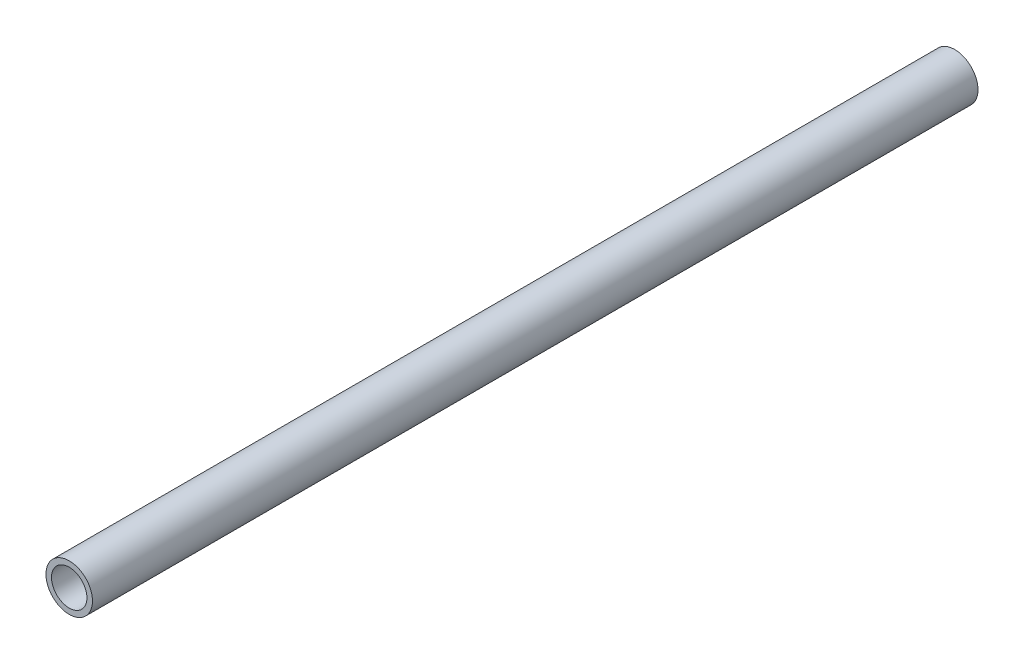
ISO-10303-21;
HEADER;
FILE_DESCRIPTION(('STEP AP214'),'2;1');
FILE_NAME('part.step','',(''),(''),'','','');
FILE_SCHEMA(('AUTOMOTIVE_DESIGN { 1 0 10303 214 1 1 1 1 }'));
ENDSEC;
DATA;
#1=APPLICATION_CONTEXT('core data for automotive mechanical design processes');
#2=APPLICATION_PROTOCOL_DEFINITION('international standard','automotive_design',2000,#1);
#3=PRODUCT_CONTEXT('',#1,'mechanical');
#4=PRODUCT('Part','Part','',(#3));
#5=PRODUCT_RELATED_PRODUCT_CATEGORY('part','',(#4));
#6=PRODUCT_DEFINITION_FORMATION('','',#4);
#7=PRODUCT_DEFINITION_CONTEXT('part definition',#1,'design');
#8=PRODUCT_DEFINITION('design','',#6,#7);
#9=PRODUCT_DEFINITION_SHAPE('','',#8);
#10=(LENGTH_UNIT() NAMED_UNIT(*) SI_UNIT(.MILLI.,.METRE.));
#11=(NAMED_UNIT(*) PLANE_ANGLE_UNIT() SI_UNIT($,.RADIAN.));
#12=(NAMED_UNIT(*) SI_UNIT($,.STERADIAN.) SOLID_ANGLE_UNIT());
#13=UNCERTAINTY_MEASURE_WITH_UNIT(LENGTH_MEASURE(1.E-05),#10,'distance_accuracy_value','');
#14=(GEOMETRIC_REPRESENTATION_CONTEXT(3) GLOBAL_UNCERTAINTY_ASSIGNED_CONTEXT((#13)) GLOBAL_UNIT_ASSIGNED_CONTEXT((#10,
#11,#12)) REPRESENTATION_CONTEXT('',''));
#15=CARTESIAN_POINT('',(0.,0.,0.));
#16=DIRECTION('',(0.,0.,1.));
#17=DIRECTION('',(1.,0.,0.));
#18=AXIS2_PLACEMENT_3D('',#15,#16,#17);
#19=CARTESIAN_POINT('',(0.,0.,-200.));
#20=DIRECTION('',(0.,0.,1.));
#21=DIRECTION('',(1.,0.,0.));
#22=AXIS2_PLACEMENT_3D('',#19,#20,#21);
#23=CYLINDRICAL_SURFACE('',#22,4.);
#24=CARTESIAN_POINT('',(0.,0.,-200.));
#25=DIRECTION('',(0.,0.,1.));
#26=DIRECTION('',(1.,0.,0.));
#27=AXIS2_PLACEMENT_3D('',#24,#25,#26);
#28=CIRCLE('',#27,4.);
#29=CARTESIAN_POINT('',(4.,0.,-200.));
#30=VERTEX_POINT('',#29);
#31=EDGE_CURVE('E40',#30,#30,#28,.T.);
#32=ORIENTED_EDGE('',*,*,#31,.F.);
#33=EDGE_LOOP('',(#32));
#34=FACE_BOUND('',#33,.T.);
#35=CARTESIAN_POINT('',(0.,0.,0.));
#36=DIRECTION('',(0.,0.,1.));
#37=DIRECTION('',(1.,0.,0.));
#38=AXIS2_PLACEMENT_3D('',#35,#36,#37);
#39=CIRCLE('',#38,4.);
#40=CARTESIAN_POINT('',(4.,0.,0.));
#41=VERTEX_POINT('',#40);
#42=EDGE_CURVE('E46',#41,#41,#39,.T.);
#43=ORIENTED_EDGE('',*,*,#42,.T.);
#44=EDGE_LOOP('',(#43));
#45=FACE_BOUND('',#44,.T.);
#46=ADVANCED_FACE('F33',(#34,#45),#23,.F.);
#47=CARTESIAN_POINT('',(0.,0.,-200.));
#48=DIRECTION('',(0.,0.,1.));
#49=DIRECTION('',(1.,0.,0.));
#50=AXIS2_PLACEMENT_3D('',#47,#48,#49);
#51=CYLINDRICAL_SURFACE('',#50,5.25);
#52=CARTESIAN_POINT('',(0.,0.,-200.));
#53=DIRECTION('',(0.,0.,1.));
#54=DIRECTION('',(1.,0.,0.));
#55=AXIS2_PLACEMENT_3D('',#52,#53,#54);
#56=CIRCLE('',#55,5.25);
#57=CARTESIAN_POINT('',(5.25,0.,-200.));
#58=VERTEX_POINT('',#57);
#59=EDGE_CURVE('E10',#58,#58,#56,.T.);
#60=ORIENTED_EDGE('',*,*,#59,.T.);
#61=EDGE_LOOP('',(#60));
#62=FACE_BOUND('',#61,.T.);
#63=CARTESIAN_POINT('',(0.,0.,0.));
#64=DIRECTION('',(0.,0.,1.));
#65=DIRECTION('',(1.,0.,0.));
#66=AXIS2_PLACEMENT_3D('',#63,#64,#65);
#67=CIRCLE('',#66,5.25);
#68=CARTESIAN_POINT('',(5.25,0.,0.));
#69=VERTEX_POINT('',#68);
#70=EDGE_CURVE('E36',#69,#69,#67,.T.);
#71=ORIENTED_EDGE('',*,*,#70,.F.);
#72=EDGE_LOOP('',(#71));
#73=FACE_BOUND('',#72,.T.);
#74=ADVANCED_FACE('F55',(#62,#73),#51,.T.);
#75=CARTESIAN_POINT('',(0.,0.,-200.));
#76=DIRECTION('',(0.,0.,1.));
#77=DIRECTION('',(1.,0.,0.));
#78=AXIS2_PLACEMENT_3D('',#75,#76,#77);
#79=PLANE('',#78);
#80=ORIENTED_EDGE('',*,*,#31,.T.);
#81=EDGE_LOOP('',(#80));
#82=FACE_BOUND('',#81,.T.);
#83=ORIENTED_EDGE('',*,*,#59,.F.);
#84=EDGE_LOOP('',(#83));
#85=FACE_BOUND('',#84,.T.);
#86=ADVANCED_FACE('F57',(#82,#85),#79,.F.);
#87=CARTESIAN_POINT('',(0.,0.,0.));
#88=DIRECTION('',(0.,0.,1.));
#89=DIRECTION('',(1.,0.,0.));
#90=AXIS2_PLACEMENT_3D('',#87,#88,#89);
#91=PLANE('',#90);
#92=ORIENTED_EDGE('',*,*,#42,.F.);
#93=EDGE_LOOP('',(#92));
#94=FACE_BOUND('',#93,.T.);
#95=ORIENTED_EDGE('',*,*,#70,.T.);
#96=EDGE_LOOP('',(#95));
#97=FACE_BOUND('',#96,.T.);
#98=ADVANCED_FACE('F53',(#94,#97),#91,.T.);
#99=CLOSED_SHELL('',(#46,#74,#86,#98));
#100=MANIFOLD_SOLID_BREP('B2',#99);
#101=ADVANCED_BREP_SHAPE_REPRESENTATION('',(#18,#100),#14);
#102=SHAPE_DEFINITION_REPRESENTATION(#9,#101);
ENDSEC;
END-ISO-10303-21;
